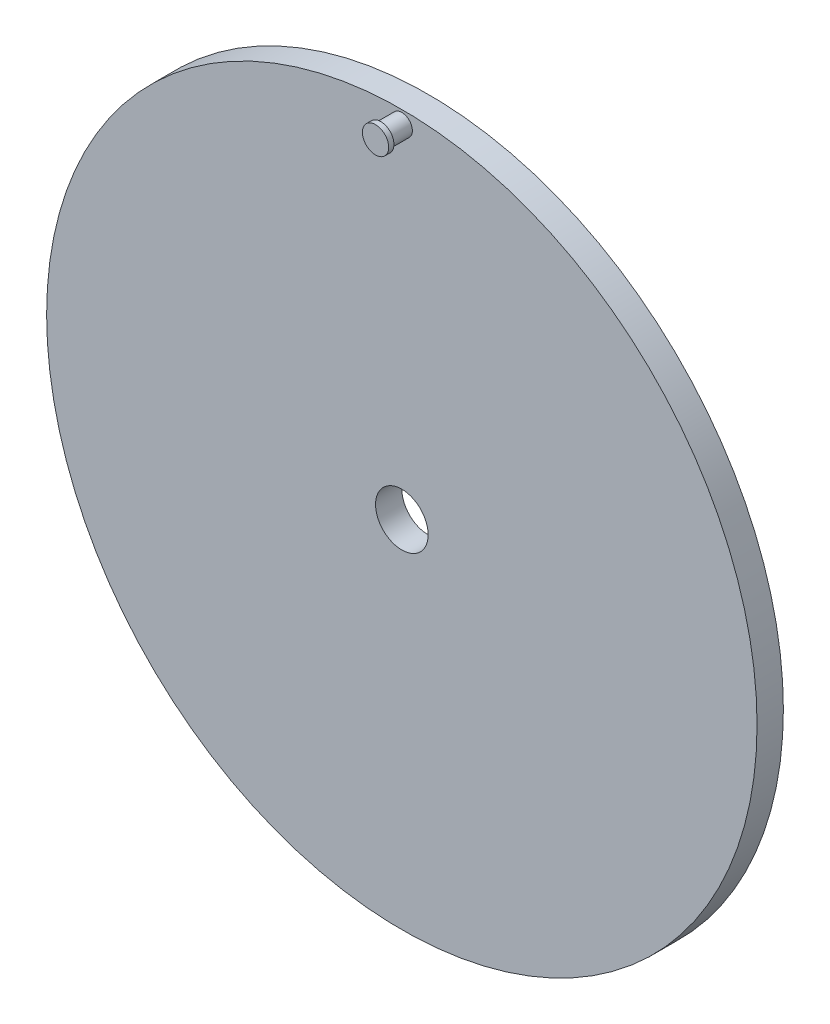
ISO-10303-21;
HEADER;
FILE_DESCRIPTION(('STEP AP214'),'2;1');
FILE_NAME('part.step','',(''),(''),'','','');
FILE_SCHEMA(('AUTOMOTIVE_DESIGN { 1 0 10303 214 1 1 1 1 }'));
ENDSEC;
DATA;
#1=APPLICATION_CONTEXT('core data for automotive mechanical design processes');
#2=APPLICATION_PROTOCOL_DEFINITION('international standard','automotive_design',2000,#1);
#3=PRODUCT_CONTEXT('',#1,'mechanical');
#4=PRODUCT('Part','Part','',(#3));
#5=PRODUCT_RELATED_PRODUCT_CATEGORY('part','',(#4));
#6=PRODUCT_DEFINITION_FORMATION('','',#4);
#7=PRODUCT_DEFINITION_CONTEXT('part definition',#1,'design');
#8=PRODUCT_DEFINITION('design','',#6,#7);
#9=PRODUCT_DEFINITION_SHAPE('','',#8);
#10=(LENGTH_UNIT() NAMED_UNIT(*) SI_UNIT(.MILLI.,.METRE.));
#11=(NAMED_UNIT(*) PLANE_ANGLE_UNIT() SI_UNIT($,.RADIAN.));
#12=(NAMED_UNIT(*) SI_UNIT($,.STERADIAN.) SOLID_ANGLE_UNIT());
#13=UNCERTAINTY_MEASURE_WITH_UNIT(LENGTH_MEASURE(1.E-05),#10,'distance_accuracy_value','');
#14=(GEOMETRIC_REPRESENTATION_CONTEXT(3) GLOBAL_UNCERTAINTY_ASSIGNED_CONTEXT((#13)) GLOBAL_UNIT_ASSIGNED_CONTEXT((#10,
#11,#12)) REPRESENTATION_CONTEXT('',''));
#15=CARTESIAN_POINT('',(0.,0.,0.));
#16=DIRECTION('',(0.,0.,1.));
#17=DIRECTION('',(1.,0.,0.));
#18=AXIS2_PLACEMENT_3D('',#15,#16,#17);
#19=CARTESIAN_POINT('',(0.,0.,2.5));
#20=DIRECTION('',(0.,0.,1.));
#21=DIRECTION('',(1.,0.,0.));
#22=AXIS2_PLACEMENT_3D('',#19,#20,#21);
#23=PLANE('',#22);
#24=CARTESIAN_POINT('',(0.,65.,2.5));
#25=DIRECTION('',(0.,0.,1.));
#26=DIRECTION('',(1.,0.,0.));
#27=AXIS2_PLACEMENT_3D('',#24,#25,#26);
#28=CIRCLE('',#27,2.);
#29=CARTESIAN_POINT('',(2.,65.,2.5));
#30=VERTEX_POINT('',#29);
#31=EDGE_CURVE('E10',#30,#30,#28,.T.);
#32=ORIENTED_EDGE('',*,*,#31,.F.);
#33=EDGE_LOOP('',(#32));
#34=FACE_BOUND('',#33,.T.);
#35=CARTESIAN_POINT('',(0.,0.,2.5));
#36=DIRECTION('',(0.,0.,1.));
#37=DIRECTION('',(1.,0.,0.));
#38=AXIS2_PLACEMENT_3D('',#35,#36,#37);
#39=CIRCLE('',#38,67.5);
#40=CARTESIAN_POINT('',(67.5,0.,2.5));
#41=VERTEX_POINT('',#40);
#42=EDGE_CURVE('E24',#41,#41,#39,.T.);
#43=ORIENTED_EDGE('',*,*,#42,.T.);
#44=EDGE_LOOP('',(#43));
#45=FACE_BOUND('',#44,.T.);
#46=CARTESIAN_POINT('',(0.,0.,2.5));
#47=DIRECTION('',(0.,0.,1.));
#48=DIRECTION('',(1.,0.,0.));
#49=AXIS2_PLACEMENT_3D('',#46,#47,#48);
#50=CIRCLE('',#49,5.);
#51=CARTESIAN_POINT('',(5.,0.,2.5));
#52=VERTEX_POINT('',#51);
#53=EDGE_CURVE('E33',#52,#52,#50,.T.);
#54=ORIENTED_EDGE('',*,*,#53,.F.);
#55=EDGE_LOOP('',(#54));
#56=FACE_BOUND('',#55,.T.);
#57=ADVANCED_FACE('F17',(#34,#45,#56),#23,.T.);
#58=CARTESIAN_POINT('',(0.,0.,-2.5));
#59=DIRECTION('',(0.,0.,1.));
#60=DIRECTION('',(1.,0.,0.));
#61=AXIS2_PLACEMENT_3D('',#58,#59,#60);
#62=PLANE('',#61);
#63=CARTESIAN_POINT('',(0.,0.,-2.5));
#64=DIRECTION('',(0.,0.,1.));
#65=DIRECTION('',(1.,0.,0.));
#66=AXIS2_PLACEMENT_3D('',#63,#64,#65);
#67=CIRCLE('',#66,67.5);
#68=CARTESIAN_POINT('',(67.5,0.,-2.5));
#69=VERTEX_POINT('',#68);
#70=EDGE_CURVE('E28',#69,#69,#67,.T.);
#71=ORIENTED_EDGE('',*,*,#70,.F.);
#72=EDGE_LOOP('',(#71));
#73=FACE_BOUND('',#72,.T.);
#74=CARTESIAN_POINT('',(0.,0.,-2.5));
#75=DIRECTION('',(0.,0.,1.));
#76=DIRECTION('',(1.,0.,0.));
#77=AXIS2_PLACEMENT_3D('',#74,#75,#76);
#78=CIRCLE('',#77,5.);
#79=CARTESIAN_POINT('',(5.,0.,-2.5));
#80=VERTEX_POINT('',#79);
#81=EDGE_CURVE('E35',#80,#80,#78,.T.);
#82=ORIENTED_EDGE('',*,*,#81,.T.);
#83=EDGE_LOOP('',(#82));
#84=FACE_BOUND('',#83,.T.);
#85=ADVANCED_FACE('F70',(#73,#84),#62,.F.);
#86=CARTESIAN_POINT('',(0.,0.,2.5));
#87=DIRECTION('',(0.,0.,-1.));
#88=DIRECTION('',(-1.,0.,0.));
#89=AXIS2_PLACEMENT_3D('',#86,#87,#88);
#90=CYLINDRICAL_SURFACE('',#89,67.5);
#91=ORIENTED_EDGE('',*,*,#42,.F.);
#92=EDGE_LOOP('',(#91));
#93=FACE_BOUND('',#92,.T.);
#94=ORIENTED_EDGE('',*,*,#70,.T.);
#95=EDGE_LOOP('',(#94));
#96=FACE_BOUND('',#95,.T.);
#97=ADVANCED_FACE('F19',(#93,#96),#90,.T.);
#98=CARTESIAN_POINT('',(0.,0.,2.5));
#99=DIRECTION('',(0.,0.,-1.));
#100=DIRECTION('',(-1.,0.,0.));
#101=AXIS2_PLACEMENT_3D('',#98,#99,#100);
#102=CYLINDRICAL_SURFACE('',#101,5.);
#103=ORIENTED_EDGE('',*,*,#53,.T.);
#104=EDGE_LOOP('',(#103));
#105=FACE_BOUND('',#104,.T.);
#106=ORIENTED_EDGE('',*,*,#81,.F.);
#107=EDGE_LOOP('',(#106));
#108=FACE_BOUND('',#107,.T.);
#109=ADVANCED_FACE('F78',(#105,#108),#102,.F.);
#110=CARTESIAN_POINT('',(0.,65.,6.5));
#111=DIRECTION('',(0.,0.,-1.));
#112=DIRECTION('',(-1.,0.,0.));
#113=AXIS2_PLACEMENT_3D('',#110,#111,#112);
#114=CYLINDRICAL_SURFACE('',#113,2.);
#115=CARTESIAN_POINT('',(0.,65.,6.5));
#116=DIRECTION('',(0.,0.,1.));
#117=DIRECTION('',(1.,0.,0.));
#118=AXIS2_PLACEMENT_3D('',#115,#116,#117);
#119=CIRCLE('',#118,2.);
#120=CARTESIAN_POINT('',(2.,65.,6.5));
#121=VERTEX_POINT('',#120);
#122=EDGE_CURVE('E38',#121,#121,#119,.F.);
#123=ORIENTED_EDGE('',*,*,#122,.T.);
#124=EDGE_LOOP('',(#123));
#125=FACE_BOUND('',#124,.T.);
#126=ORIENTED_EDGE('',*,*,#31,.T.);
#127=EDGE_LOOP('',(#126));
#128=FACE_BOUND('',#127,.T.);
#129=ADVANCED_FACE('F55',(#125,#128),#114,.T.);
#130=CARTESIAN_POINT('',(0.,65.,7.5));
#131=DIRECTION('',(0.,0.,-1.));
#132=DIRECTION('',(-1.,0.,0.));
#133=AXIS2_PLACEMENT_3D('',#130,#131,#132);
#134=CYLINDRICAL_SURFACE('',#133,2.5);
#135=CARTESIAN_POINT('',(0.,65.,7.5));
#136=DIRECTION('',(0.,0.,1.));
#137=DIRECTION('',(1.,0.,0.));
#138=AXIS2_PLACEMENT_3D('',#135,#136,#137);
#139=CIRCLE('',#138,2.5);
#140=CARTESIAN_POINT('',(2.5,65.,7.5));
#141=VERTEX_POINT('',#140);
#142=EDGE_CURVE('E43',#141,#141,#139,.T.);
#143=ORIENTED_EDGE('',*,*,#142,.F.);
#144=EDGE_LOOP('',(#143));
#145=FACE_BOUND('',#144,.T.);
#146=CARTESIAN_POINT('',(0.,65.,6.5));
#147=DIRECTION('',(0.,0.,1.));
#148=DIRECTION('',(1.,0.,0.));
#149=AXIS2_PLACEMENT_3D('',#146,#147,#148);
#150=CIRCLE('',#149,2.5);
#151=CARTESIAN_POINT('',(2.5,65.,6.5));
#152=VERTEX_POINT('',#151);
#153=EDGE_CURVE('E44',#152,#152,#150,.T.);
#154=ORIENTED_EDGE('',*,*,#153,.T.);
#155=EDGE_LOOP('',(#154));
#156=FACE_BOUND('',#155,.T.);
#157=ADVANCED_FACE('F52',(#145,#156),#134,.T.);
#158=CARTESIAN_POINT('',(0.,65.,7.5));
#159=DIRECTION('',(0.,0.,1.));
#160=DIRECTION('',(1.,0.,0.));
#161=AXIS2_PLACEMENT_3D('',#158,#159,#160);
#162=PLANE('',#161);
#163=ORIENTED_EDGE('',*,*,#142,.T.);
#164=EDGE_LOOP('',(#163));
#165=FACE_BOUND('',#164,.T.);
#166=ADVANCED_FACE('F50',(#165),#162,.T.);
#167=CARTESIAN_POINT('',(0.,65.,6.5));
#168=DIRECTION('',(0.,0.,1.));
#169=DIRECTION('',(1.,0.,0.));
#170=AXIS2_PLACEMENT_3D('',#167,#168,#169);
#171=PLANE('',#170);
#172=ORIENTED_EDGE('',*,*,#122,.F.);
#173=EDGE_LOOP('',(#172));
#174=FACE_BOUND('',#173,.T.);
#175=ORIENTED_EDGE('',*,*,#153,.F.);
#176=EDGE_LOOP('',(#175));
#177=FACE_BOUND('',#176,.T.);
#178=ADVANCED_FACE('F59',(#174,#177),#171,.F.);
#179=CLOSED_SHELL('',(#57,#85,#97,#109,#129,#157,#166,#178));
#180=MANIFOLD_SOLID_BREP('B1',#179);
#181=ADVANCED_BREP_SHAPE_REPRESENTATION('',(#18,#180),#14);
#182=SHAPE_DEFINITION_REPRESENTATION(#9,#181);
ENDSEC;
END-ISO-10303-21;
